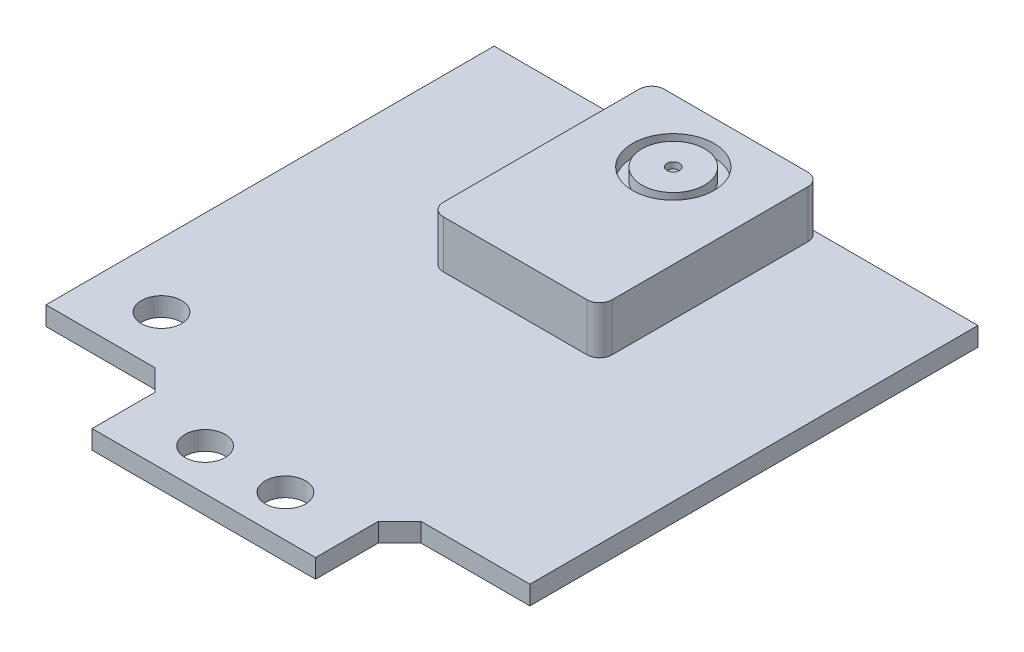
ISO-10303-21;
HEADER;
FILE_DESCRIPTION(('STEP AP214'),'2;1');
FILE_NAME('part.step','',(''),(''),'','','');
FILE_SCHEMA(('AUTOMOTIVE_DESIGN { 1 0 10303 214 1 1 1 1 }'));
ENDSEC;
DATA;
#1=APPLICATION_CONTEXT('core data for automotive mechanical design processes');
#2=APPLICATION_PROTOCOL_DEFINITION('international standard','automotive_design',2000,#1);
#3=PRODUCT_CONTEXT('',#1,'mechanical');
#4=PRODUCT('Part','Part','',(#3));
#5=PRODUCT_RELATED_PRODUCT_CATEGORY('part','',(#4));
#6=PRODUCT_DEFINITION_FORMATION('','',#4);
#7=PRODUCT_DEFINITION_CONTEXT('part definition',#1,'design');
#8=PRODUCT_DEFINITION('design','',#6,#7);
#9=PRODUCT_DEFINITION_SHAPE('','',#8);
#10=(LENGTH_UNIT() NAMED_UNIT(*) SI_UNIT(.MILLI.,.METRE.));
#11=(NAMED_UNIT(*) PLANE_ANGLE_UNIT() SI_UNIT($,.RADIAN.));
#12=(NAMED_UNIT(*) SI_UNIT($,.STERADIAN.) SOLID_ANGLE_UNIT());
#13=UNCERTAINTY_MEASURE_WITH_UNIT(LENGTH_MEASURE(1.E-05),#10,'distance_accuracy_value','');
#14=(GEOMETRIC_REPRESENTATION_CONTEXT(3) GLOBAL_UNCERTAINTY_ASSIGNED_CONTEXT((#13)) GLOBAL_UNIT_ASSIGNED_CONTEXT((#10,
#11,#12)) REPRESENTATION_CONTEXT('',''));
#15=CARTESIAN_POINT('',(0.,0.,0.));
#16=DIRECTION('',(0.,0.,1.));
#17=DIRECTION('',(1.,0.,0.));
#18=AXIS2_PLACEMENT_3D('',#15,#16,#17);
#19=CARTESIAN_POINT('',(6.725,5.3,0.));
#20=DIRECTION('',(-1.,0.,0.));
#21=DIRECTION('',(0.,0.,1.));
#22=AXIS2_PLACEMENT_3D('',#19,#20,#21);
#23=PLANE('',#22);
#24=DIRECTION('',(0.,0.,-1.));
#25=VECTOR('',#24,1.);
#26=CARTESIAN_POINT('',(6.725,1.5,0.));
#27=LINE('',#26,#25);
#28=CARTESIAN_POINT('',(6.725,1.5,-1.25));
#29=VERTEX_POINT('',#28);
#30=CARTESIAN_POINT('',(6.725,1.5,-16.85));
#31=VERTEX_POINT('',#30);
#32=EDGE_CURVE('E253',#29,#31,#27,.T.);
#33=ORIENTED_EDGE('',*,*,#32,.T.);
#34=DIRECTION('',(0.,-1.,0.));
#35=VECTOR('',#34,1.);
#36=CARTESIAN_POINT('',(6.725,5.3,-16.85));
#37=LINE('',#36,#35);
#38=CARTESIAN_POINT('',(6.725,5.3,-16.85));
#39=VERTEX_POINT('',#38);
#40=EDGE_CURVE('E13',#39,#31,#37,.T.);
#41=ORIENTED_EDGE('',*,*,#40,.F.);
#42=DIRECTION('',(0.,0.,-1.));
#43=VECTOR('',#42,1.);
#44=CARTESIAN_POINT('',(6.725,5.3,0.));
#45=LINE('',#44,#43);
#46=CARTESIAN_POINT('',(6.725,5.3,-1.25));
#47=VERTEX_POINT('',#46);
#48=EDGE_CURVE('E211',#47,#39,#45,.T.);
#49=ORIENTED_EDGE('',*,*,#48,.F.);
#50=DIRECTION('',(0.,-1.,0.));
#51=VECTOR('',#50,1.);
#52=CARTESIAN_POINT('',(6.725,5.3,-1.25));
#53=LINE('',#52,#51);
#54=EDGE_CURVE('E174',#47,#29,#53,.T.);
#55=ORIENTED_EDGE('',*,*,#54,.T.);
#56=EDGE_LOOP('',(#33,#41,#49,#55));
#57=FACE_BOUND('',#56,.T.);
#58=ADVANCED_FACE('F158',(#57),#23,.F.);
#59=CARTESIAN_POINT('',(5.725,5.3,-16.85));
#60=DIRECTION('',(0.,-1.,0.));
#61=DIRECTION('',(0.,0.,-1.));
#62=AXIS2_PLACEMENT_3D('',#59,#60,#61);
#63=CYLINDRICAL_SURFACE('',#62,1.);
#64=CARTESIAN_POINT('',(5.725,1.5,-16.85));
#65=DIRECTION('',(0.,-1.,0.));
#66=DIRECTION('',(0.,0.,-1.));
#67=AXIS2_PLACEMENT_3D('',#64,#65,#66);
#68=CIRCLE('',#67,1.);
#69=CARTESIAN_POINT('',(5.725,1.5,-17.85));
#70=VERTEX_POINT('',#69);
#71=EDGE_CURVE('E255',#70,#31,#68,.T.);
#72=ORIENTED_EDGE('',*,*,#71,.F.);
#73=DIRECTION('',(0.,-1.,0.));
#74=VECTOR('',#73,1.);
#75=CARTESIAN_POINT('',(5.725,5.3,-17.85));
#76=LINE('',#75,#74);
#77=CARTESIAN_POINT('',(5.725,5.3,-17.85));
#78=VERTEX_POINT('',#77);
#79=EDGE_CURVE('E166',#78,#70,#76,.T.);
#80=ORIENTED_EDGE('',*,*,#79,.F.);
#81=CARTESIAN_POINT('',(5.725,5.3,-16.85));
#82=DIRECTION('',(0.,-1.,0.));
#83=DIRECTION('',(0.,0.,-1.));
#84=AXIS2_PLACEMENT_3D('',#81,#82,#83);
#85=CIRCLE('',#84,1.);
#86=EDGE_CURVE('E293',#78,#39,#85,.T.);
#87=ORIENTED_EDGE('',*,*,#86,.T.);
#88=ORIENTED_EDGE('',*,*,#40,.T.);
#89=EDGE_LOOP('',(#72,#80,#87,#88));
#90=FACE_BOUND('',#89,.T.);
#91=ADVANCED_FACE('F292',(#90),#63,.T.);
#92=CARTESIAN_POINT('',(0.,5.3,-17.85));
#93=DIRECTION('',(0.,0.,1.));
#94=DIRECTION('',(1.,0.,0.));
#95=AXIS2_PLACEMENT_3D('',#92,#93,#94);
#96=PLANE('',#95);
#97=DIRECTION('',(-1.,0.,0.));
#98=VECTOR('',#97,1.);
#99=CARTESIAN_POINT('',(0.,1.5,-17.85));
#100=LINE('',#99,#98);
#101=CARTESIAN_POINT('',(-5.725,1.5,-17.85));
#102=VERTEX_POINT('',#101);
#103=EDGE_CURVE('E259',#70,#102,#100,.T.);
#104=ORIENTED_EDGE('',*,*,#103,.T.);
#105=DIRECTION('',(0.,-1.,0.));
#106=VECTOR('',#105,1.);
#107=CARTESIAN_POINT('',(-5.725,5.3,-17.85));
#108=LINE('',#107,#106);
#109=CARTESIAN_POINT('',(-5.725,5.3,-17.85));
#110=VERTEX_POINT('',#109);
#111=EDGE_CURVE('E279',#110,#102,#108,.T.);
#112=ORIENTED_EDGE('',*,*,#111,.F.);
#113=DIRECTION('',(-1.,0.,0.));
#114=VECTOR('',#113,1.);
#115=CARTESIAN_POINT('',(0.,5.3,-17.85));
#116=LINE('',#115,#114);
#117=EDGE_CURVE('E285',#78,#110,#116,.T.);
#118=ORIENTED_EDGE('',*,*,#117,.F.);
#119=ORIENTED_EDGE('',*,*,#79,.T.);
#120=EDGE_LOOP('',(#104,#112,#118,#119));
#121=FACE_BOUND('',#120,.T.);
#122=ADVANCED_FACE('F283',(#121),#96,.F.);
#123=CARTESIAN_POINT('',(-5.725,5.3,-16.85));
#124=DIRECTION('',(0.,-1.,0.));
#125=DIRECTION('',(0.,0.,-1.));
#126=AXIS2_PLACEMENT_3D('',#123,#124,#125);
#127=CYLINDRICAL_SURFACE('',#126,1.);
#128=CARTESIAN_POINT('',(-5.725,1.5,-16.85));
#129=DIRECTION('',(0.,-1.,0.));
#130=DIRECTION('',(0.,0.,-1.));
#131=AXIS2_PLACEMENT_3D('',#128,#129,#130);
#132=CIRCLE('',#131,1.);
#133=CARTESIAN_POINT('',(-6.725,1.5,-16.85));
#134=VERTEX_POINT('',#133);
#135=EDGE_CURVE('E262',#134,#102,#132,.T.);
#136=ORIENTED_EDGE('',*,*,#135,.F.);
#137=DIRECTION('',(0.,-1.,0.));
#138=VECTOR('',#137,1.);
#139=CARTESIAN_POINT('',(-6.725,5.3,-16.85));
#140=LINE('',#139,#138);
#141=CARTESIAN_POINT('',(-6.725,5.3,-16.85));
#142=VERTEX_POINT('',#141);
#143=EDGE_CURVE('E277',#142,#134,#140,.T.);
#144=ORIENTED_EDGE('',*,*,#143,.F.);
#145=CARTESIAN_POINT('',(-5.725,5.3,-16.85));
#146=DIRECTION('',(0.,-1.,0.));
#147=DIRECTION('',(0.,0.,-1.));
#148=AXIS2_PLACEMENT_3D('',#145,#146,#147);
#149=CIRCLE('',#148,1.);
#150=EDGE_CURVE('E480',#142,#110,#149,.T.);
#151=ORIENTED_EDGE('',*,*,#150,.T.);
#152=ORIENTED_EDGE('',*,*,#111,.T.);
#153=EDGE_LOOP('',(#136,#144,#151,#152));
#154=FACE_BOUND('',#153,.T.);
#155=ADVANCED_FACE('F313',(#154),#127,.T.);
#156=CARTESIAN_POINT('',(-6.725,5.3,0.));
#157=DIRECTION('',(-1.,0.,0.));
#158=DIRECTION('',(0.,0.,1.));
#159=AXIS2_PLACEMENT_3D('',#156,#157,#158);
#160=PLANE('',#159);
#161=DIRECTION('',(0.,0.,-1.));
#162=VECTOR('',#161,1.);
#163=CARTESIAN_POINT('',(-6.725,1.5,0.));
#164=LINE('',#163,#162);
#165=CARTESIAN_POINT('',(-6.725,1.5,-1.25));
#166=VERTEX_POINT('',#165);
#167=EDGE_CURVE('E265',#166,#134,#164,.T.);
#168=ORIENTED_EDGE('',*,*,#167,.F.);
#169=DIRECTION('',(0.,-1.,0.));
#170=VECTOR('',#169,1.);
#171=CARTESIAN_POINT('',(-6.725,5.3,-1.25));
#172=LINE('',#171,#170);
#173=CARTESIAN_POINT('',(-6.725,5.3,-1.25));
#174=VERTEX_POINT('',#173);
#175=EDGE_CURVE('E237',#174,#166,#172,.T.);
#176=ORIENTED_EDGE('',*,*,#175,.F.);
#177=DIRECTION('',(0.,0.,-1.));
#178=VECTOR('',#177,1.);
#179=CARTESIAN_POINT('',(-6.725,5.3,0.));
#180=LINE('',#179,#178);
#181=EDGE_CURVE('E245',#174,#142,#180,.T.);
#182=ORIENTED_EDGE('',*,*,#181,.T.);
#183=ORIENTED_EDGE('',*,*,#143,.T.);
#184=EDGE_LOOP('',(#168,#176,#182,#183));
#185=FACE_BOUND('',#184,.T.);
#186=ADVANCED_FACE('F318',(#185),#160,.T.);
#187=CARTESIAN_POINT('',(-5.725,5.3,-1.25));
#188=DIRECTION('',(0.,-1.,0.));
#189=DIRECTION('',(0.,0.,-1.));
#190=AXIS2_PLACEMENT_3D('',#187,#188,#189);
#191=CYLINDRICAL_SURFACE('',#190,1.);
#192=CARTESIAN_POINT('',(-5.725,1.5,-1.25));
#193=DIRECTION('',(0.,-1.,0.));
#194=DIRECTION('',(0.,0.,-1.));
#195=AXIS2_PLACEMENT_3D('',#192,#193,#194);
#196=CIRCLE('',#195,1.);
#197=CARTESIAN_POINT('',(-5.725,1.5,-0.249999999999999));
#198=VERTEX_POINT('',#197);
#199=EDGE_CURVE('E233',#198,#166,#196,.T.);
#200=ORIENTED_EDGE('',*,*,#199,.F.);
#201=DIRECTION('',(0.,-1.,0.));
#202=VECTOR('',#201,1.);
#203=CARTESIAN_POINT('',(-5.725,5.3,-0.249999999999999));
#204=LINE('',#203,#202);
#205=CARTESIAN_POINT('',(-5.725,5.3,-0.249999999999999));
#206=VERTEX_POINT('',#205);
#207=EDGE_CURVE('E228',#206,#198,#204,.T.);
#208=ORIENTED_EDGE('',*,*,#207,.F.);
#209=CARTESIAN_POINT('',(-5.725,5.3,-1.25));
#210=DIRECTION('',(0.,-1.,0.));
#211=DIRECTION('',(0.,0.,-1.));
#212=AXIS2_PLACEMENT_3D('',#209,#210,#211);
#213=CIRCLE('',#212,1.);
#214=EDGE_CURVE('E231',#206,#174,#213,.T.);
#215=ORIENTED_EDGE('',*,*,#214,.T.);
#216=ORIENTED_EDGE('',*,*,#175,.T.);
#217=EDGE_LOOP('',(#200,#208,#215,#216));
#218=FACE_BOUND('',#217,.T.);
#219=ADVANCED_FACE('F230',(#218),#191,.T.);
#220=CARTESIAN_POINT('',(0.,5.3,-0.249999999999999));
#221=DIRECTION('',(0.,0.,1.));
#222=DIRECTION('',(1.,0.,0.));
#223=AXIS2_PLACEMENT_3D('',#220,#221,#222);
#224=PLANE('',#223);
#225=DIRECTION('',(-1.,0.,0.));
#226=VECTOR('',#225,1.);
#227=CARTESIAN_POINT('',(0.,1.5,-0.249999999999999));
#228=LINE('',#227,#226);
#229=CARTESIAN_POINT('',(5.725,1.5,-0.25));
#230=VERTEX_POINT('',#229);
#231=EDGE_CURVE('E269',#230,#198,#228,.T.);
#232=ORIENTED_EDGE('',*,*,#231,.F.);
#233=DIRECTION('',(0.,-1.,0.));
#234=VECTOR('',#233,1.);
#235=CARTESIAN_POINT('',(5.725,5.3,-0.25));
#236=LINE('',#235,#234);
#237=CARTESIAN_POINT('',(5.725,5.3,-0.25));
#238=VERTEX_POINT('',#237);
#239=EDGE_CURVE('E199',#238,#230,#236,.T.);
#240=ORIENTED_EDGE('',*,*,#239,.F.);
#241=DIRECTION('',(-1.,0.,0.));
#242=VECTOR('',#241,1.);
#243=CARTESIAN_POINT('',(0.,5.3,-0.249999999999999));
#244=LINE('',#243,#242);
#245=EDGE_CURVE('E242',#238,#206,#244,.T.);
#246=ORIENTED_EDGE('',*,*,#245,.T.);
#247=ORIENTED_EDGE('',*,*,#207,.T.);
#248=EDGE_LOOP('',(#232,#240,#246,#247));
#249=FACE_BOUND('',#248,.T.);
#250=ADVANCED_FACE('F247',(#249),#224,.T.);
#251=CARTESIAN_POINT('',(5.725,5.3,-1.25));
#252=DIRECTION('',(0.,-1.,0.));
#253=DIRECTION('',(0.,0.,-1.));
#254=AXIS2_PLACEMENT_3D('',#251,#252,#253);
#255=CYLINDRICAL_SURFACE('',#254,1.);
#256=CARTESIAN_POINT('',(5.725,1.5,-1.25));
#257=DIRECTION('',(0.,-1.,0.));
#258=DIRECTION('',(0.,0.,-1.));
#259=AXIS2_PLACEMENT_3D('',#256,#257,#258);
#260=CIRCLE('',#259,1.);
#261=EDGE_CURVE('E271',#29,#230,#260,.T.);
#262=ORIENTED_EDGE('',*,*,#261,.F.);
#263=ORIENTED_EDGE('',*,*,#54,.F.);
#264=CARTESIAN_POINT('',(5.725,5.3,-1.25));
#265=DIRECTION('',(0.,-1.,0.));
#266=DIRECTION('',(0.,0.,-1.));
#267=AXIS2_PLACEMENT_3D('',#264,#265,#266);
#268=CIRCLE('',#267,1.);
#269=EDGE_CURVE('E248',#47,#238,#268,.T.);
#270=ORIENTED_EDGE('',*,*,#269,.T.);
#271=ORIENTED_EDGE('',*,*,#239,.T.);
#272=EDGE_LOOP('',(#262,#263,#270,#271));
#273=FACE_BOUND('',#272,.T.);
#274=ADVANCED_FACE('F294',(#273),#255,.T.);
#275=CARTESIAN_POINT('',(5.725,5.3,-16.85));
#276=DIRECTION('',(0.,-1.,0.));
#277=DIRECTION('',(0.,0.,-1.));
#278=AXIS2_PLACEMENT_3D('',#275,#276,#277);
#279=PLANE('',#278);
#280=CARTESIAN_POINT('',(0.,5.3,-12.85));
#281=DIRECTION('',(0.,-1.,0.));
#282=DIRECTION('',(0.,0.,-1.));
#283=AXIS2_PLACEMENT_3D('',#280,#281,#282);
#284=CIRCLE('',#283,3.25);
#285=CARTESIAN_POINT('',(0.,5.3,-16.1));
#286=VERTEX_POINT('',#285);
#287=EDGE_CURVE('E471',#286,#286,#284,.T.);
#288=ORIENTED_EDGE('',*,*,#287,.T.);
#289=EDGE_LOOP('',(#288));
#290=FACE_BOUND('',#289,.T.);
#291=ORIENTED_EDGE('',*,*,#48,.T.);
#292=ORIENTED_EDGE('',*,*,#86,.F.);
#293=ORIENTED_EDGE('',*,*,#117,.T.);
#294=ORIENTED_EDGE('',*,*,#150,.F.);
#295=ORIENTED_EDGE('',*,*,#181,.F.);
#296=ORIENTED_EDGE('',*,*,#214,.F.);
#297=ORIENTED_EDGE('',*,*,#245,.F.);
#298=ORIENTED_EDGE('',*,*,#269,.F.);
#299=EDGE_LOOP('',(#291,#292,#293,#294,#295,#296,#297,#298));
#300=FACE_BOUND('',#299,.T.);
#301=ADVANCED_FACE('F241',(#290,#300),#279,.F.);
#302=CARTESIAN_POINT('',(5.725,1.5,-16.85));
#303=DIRECTION('',(0.,-1.,0.));
#304=DIRECTION('',(0.,0.,-1.));
#305=AXIS2_PLACEMENT_3D('',#302,#303,#304);
#306=PLANE('',#305);
#307=ORIENTED_EDGE('',*,*,#32,.F.);
#308=ORIENTED_EDGE('',*,*,#261,.T.);
#309=ORIENTED_EDGE('',*,*,#231,.T.);
#310=ORIENTED_EDGE('',*,*,#199,.T.);
#311=ORIENTED_EDGE('',*,*,#167,.T.);
#312=ORIENTED_EDGE('',*,*,#135,.T.);
#313=ORIENTED_EDGE('',*,*,#103,.F.);
#314=ORIENTED_EDGE('',*,*,#71,.T.);
#315=EDGE_LOOP('',(#307,#308,#309,#310,#311,#312,#313,#314));
#316=FACE_BOUND('',#315,.T.);
#317=ADVANCED_FACE('F290',(#316),#306,.T.);
#318=CARTESIAN_POINT('',(0.,4.3,-12.85));
#319=DIRECTION('',(0.,-1.,0.));
#320=DIRECTION('',(0.,0.,-1.));
#321=AXIS2_PLACEMENT_3D('',#318,#319,#320);
#322=PLANE('',#321);
#323=CARTESIAN_POINT('',(0.,4.3,-12.85));
#324=DIRECTION('',(0.,-1.,0.));
#325=DIRECTION('',(0.,0.,-1.));
#326=AXIS2_PLACEMENT_3D('',#323,#324,#325);
#327=CIRCLE('',#326,3.25);
#328=CARTESIAN_POINT('',(0.,4.3,-16.1));
#329=VERTEX_POINT('',#328);
#330=EDGE_CURVE('E256',#329,#329,#327,.T.);
#331=ORIENTED_EDGE('',*,*,#330,.F.);
#332=EDGE_LOOP('',(#331));
#333=FACE_BOUND('',#332,.T.);
#334=CARTESIAN_POINT('',(0.,4.3,-12.85));
#335=DIRECTION('',(0.,-1.,0.));
#336=DIRECTION('',(0.,0.,-1.));
#337=AXIS2_PLACEMENT_3D('',#334,#335,#336);
#338=CIRCLE('',#337,2.5);
#339=CARTESIAN_POINT('',(0.,4.3,-15.35));
#340=VERTEX_POINT('',#339);
#341=EDGE_CURVE('E465',#340,#340,#338,.T.);
#342=ORIENTED_EDGE('',*,*,#341,.T.);
#343=EDGE_LOOP('',(#342));
#344=FACE_BOUND('',#343,.T.);
#345=ADVANCED_FACE('F347',(#333,#344),#322,.F.);
#346=CARTESIAN_POINT('',(0.,4.3,-12.85));
#347=DIRECTION('',(0.,1.,0.));
#348=DIRECTION('',(0.,0.,1.));
#349=AXIS2_PLACEMENT_3D('',#346,#347,#348);
#350=CYLINDRICAL_SURFACE('',#349,3.25);
#351=ORIENTED_EDGE('',*,*,#330,.T.);
#352=EDGE_LOOP('',(#351));
#353=FACE_BOUND('',#352,.T.);
#354=ORIENTED_EDGE('',*,*,#287,.F.);
#355=EDGE_LOOP('',(#354));
#356=FACE_BOUND('',#355,.T.);
#357=ADVANCED_FACE('F354',(#353,#356),#350,.F.);
#358=CARTESIAN_POINT('',(0.,4.3,-12.85));
#359=DIRECTION('',(0.,1.,0.));
#360=DIRECTION('',(0.,0.,1.));
#361=AXIS2_PLACEMENT_3D('',#358,#359,#360);
#362=CYLINDRICAL_SURFACE('',#361,2.5);
#363=ORIENTED_EDGE('',*,*,#341,.F.);
#364=EDGE_LOOP('',(#363));
#365=FACE_BOUND('',#364,.T.);
#366=CARTESIAN_POINT('',(0.,5.3,-12.85));
#367=DIRECTION('',(0.,-1.,0.));
#368=DIRECTION('',(0.,0.,-1.));
#369=AXIS2_PLACEMENT_3D('',#366,#367,#368);
#370=CIRCLE('',#369,2.5);
#371=CARTESIAN_POINT('',(0.,5.3,-15.35));
#372=VERTEX_POINT('',#371);
#373=EDGE_CURVE('E461',#372,#372,#370,.T.);
#374=ORIENTED_EDGE('',*,*,#373,.T.);
#375=EDGE_LOOP('',(#374));
#376=FACE_BOUND('',#375,.T.);
#377=ADVANCED_FACE('F363',(#365,#376),#362,.T.);
#378=CARTESIAN_POINT('',(0.,5.3,-12.85));
#379=DIRECTION('',(0.,1.,0.));
#380=DIRECTION('',(0.,0.,1.));
#381=AXIS2_PLACEMENT_3D('',#378,#379,#380);
#382=CIRCLE('',#381,0.5);
#383=CARTESIAN_POINT('',(0.,5.3,-12.35));
#384=VERTEX_POINT('',#383);
#385=EDGE_CURVE('E462',#384,#384,#382,.T.);
#386=ORIENTED_EDGE('',*,*,#385,.F.);
#387=EDGE_LOOP('',(#386));
#388=FACE_BOUND('',#387,.T.);
#389=ORIENTED_EDGE('',*,*,#373,.F.);
#390=EDGE_LOOP('',(#389));
#391=FACE_BOUND('',#390,.T.);
#392=ADVANCED_FACE('F303',(#388,#391),#279,.F.);
#393=CARTESIAN_POINT('',(0.,4.8,-12.85));
#394=DIRECTION('',(0.,1.,0.));
#395=DIRECTION('',(0.,0.,1.));
#396=AXIS2_PLACEMENT_3D('',#393,#394,#395);
#397=CYLINDRICAL_SURFACE('',#396,0.5);
#398=CARTESIAN_POINT('',(0.,4.8,-12.85));
#399=DIRECTION('',(0.,1.,0.));
#400=DIRECTION('',(0.,0.,1.));
#401=AXIS2_PLACEMENT_3D('',#398,#399,#400);
#402=CIRCLE('',#401,0.5);
#403=CARTESIAN_POINT('',(0.,4.8,-12.35));
#404=VERTEX_POINT('',#403);
#405=EDGE_CURVE('E460',#404,#404,#402,.T.);
#406=ORIENTED_EDGE('',*,*,#405,.F.);
#407=EDGE_LOOP('',(#406));
#408=FACE_BOUND('',#407,.T.);
#409=ORIENTED_EDGE('',*,*,#385,.T.);
#410=EDGE_LOOP('',(#409));
#411=FACE_BOUND('',#410,.T.);
#412=ADVANCED_FACE('F381',(#408,#411),#397,.F.);
#413=CARTESIAN_POINT('',(0.,4.8,-12.85));
#414=DIRECTION('',(0.,1.,0.));
#415=DIRECTION('',(0.,0.,1.));
#416=AXIS2_PLACEMENT_3D('',#413,#414,#415);
#417=PLANE('',#416);
#418=ORIENTED_EDGE('',*,*,#405,.T.);
#419=EDGE_LOOP('',(#418));
#420=FACE_BOUND('',#419,.T.);
#421=ADVANCED_FACE('F388',(#420),#417,.T.);
#422=CLOSED_SHELL('',(#58,#91,#122,#155,#186,#219,#250,#274,#301,#317,#345,#357,#377,#392,#412,#421));
#423=MANIFOLD_SOLID_BREP('B2',#422);
#424=CARTESIAN_POINT('',(0.,1.5,0.));
#425=DIRECTION('',(0.,-1.,0.));
#426=DIRECTION('',(0.,0.,-1.));
#427=AXIS2_PLACEMENT_3D('',#424,#425,#426);
#428=PLANE('',#427);
#429=CARTESIAN_POINT('',(3.20000000000001,1.5,21.25));
#430=DIRECTION('',(0.,1.,0.));
#431=DIRECTION('',(0.,0.,1.));
#432=AXIS2_PLACEMENT_3D('',#429,#430,#431);
#433=CIRCLE('',#432,1.6);
#434=CARTESIAN_POINT('',(3.20000000000001,1.5,22.85));
#435=VERTEX_POINT('',#434);
#436=EDGE_CURVE('E730',#435,#435,#433,.F.);
#437=ORIENTED_EDGE('',*,*,#436,.T.);
#438=EDGE_LOOP('',(#437));
#439=FACE_BOUND('',#438,.T.);
#440=DIRECTION('',(1.,0.,0.));
#441=VECTOR('',#440,1.);
#442=CARTESIAN_POINT('',(-19.275,1.5,-17.85));
#443=LINE('',#442,#441);
#444=CARTESIAN_POINT('',(-19.275,1.5,-17.85));
#445=VERTEX_POINT('',#444);
#446=CARTESIAN_POINT('',(19.275,1.5,-17.85));
#447=VERTEX_POINT('',#446);
#448=EDGE_CURVE('E659',#445,#447,#443,.T.);
#449=ORIENTED_EDGE('',*,*,#448,.F.);
#450=DIRECTION('',(0.,0.,1.));
#451=VECTOR('',#450,1.);
#452=CARTESIAN_POINT('',(-19.275,1.5,-17.85));
#453=LINE('',#452,#451);
#454=CARTESIAN_POINT('',(-19.275,1.5,17.85));
#455=VERTEX_POINT('',#454);
#456=EDGE_CURVE('E598',#445,#455,#453,.T.);
#457=ORIENTED_EDGE('',*,*,#456,.T.);
#458=DIRECTION('',(1.,0.,0.));
#459=VECTOR('',#458,1.);
#460=CARTESIAN_POINT('',(-19.275,1.5,17.85));
#461=LINE('',#460,#459);
#462=CARTESIAN_POINT('',(-10.6,1.5,17.85));
#463=VERTEX_POINT('',#462);
#464=EDGE_CURVE('E591',#455,#463,#461,.T.);
#465=ORIENTED_EDGE('',*,*,#464,.T.);
#466=DIRECTION('',(0.707106781186547,0.,0.707106781186548));
#467=VECTOR('',#466,1.);
#468=CARTESIAN_POINT('',(-10.6,1.5,17.85));
#469=LINE('',#468,#467);
#470=CARTESIAN_POINT('',(-8.9,1.5,19.55));
#471=VERTEX_POINT('',#470);
#472=EDGE_CURVE('E596',#463,#471,#469,.T.);
#473=ORIENTED_EDGE('',*,*,#472,.T.);
#474=DIRECTION('',(0.,0.,1.));
#475=VECTOR('',#474,1.);
#476=CARTESIAN_POINT('',(-8.9,1.5,19.55));
#477=LINE('',#476,#475);
#478=CARTESIAN_POINT('',(-8.89999999999999,1.5,24.55));
#479=VERTEX_POINT('',#478);
#480=EDGE_CURVE('E616',#471,#479,#477,.T.);
#481=ORIENTED_EDGE('',*,*,#480,.T.);
#482=DIRECTION('',(1.,0.,0.));
#483=VECTOR('',#482,1.);
#484=CARTESIAN_POINT('',(-8.89999999999999,1.5,24.55));
#485=LINE('',#484,#483);
#486=CARTESIAN_POINT('',(8.90000000000001,1.5,24.55));
#487=VERTEX_POINT('',#486);
#488=EDGE_CURVE('E619',#479,#487,#485,.T.);
#489=ORIENTED_EDGE('',*,*,#488,.T.);
#490=DIRECTION('',(0.,0.,1.));
#491=VECTOR('',#490,1.);
#492=CARTESIAN_POINT('',(8.90000000000001,1.5,19.55));
#493=LINE('',#492,#491);
#494=CARTESIAN_POINT('',(8.90000000000001,1.5,19.55));
#495=VERTEX_POINT('',#494);
#496=EDGE_CURVE('E695',#495,#487,#493,.T.);
#497=ORIENTED_EDGE('',*,*,#496,.F.);
#498=DIRECTION('',(-0.707106781186547,0.,0.707106781186548));
#499=VECTOR('',#498,1.);
#500=CARTESIAN_POINT('',(10.6,1.5,17.85));
#501=LINE('',#500,#499);
#502=CARTESIAN_POINT('',(10.6,1.5,17.85));
#503=VERTEX_POINT('',#502);
#504=EDGE_CURVE('E704',#503,#495,#501,.T.);
#505=ORIENTED_EDGE('',*,*,#504,.F.);
#506=DIRECTION('',(-1.,0.,0.));
#507=VECTOR('',#506,1.);
#508=CARTESIAN_POINT('',(19.275,1.5,17.85));
#509=LINE('',#508,#507);
#510=CARTESIAN_POINT('',(19.275,1.5,17.85));
#511=VERTEX_POINT('',#510);
#512=EDGE_CURVE('E707',#511,#503,#509,.T.);
#513=ORIENTED_EDGE('',*,*,#512,.F.);
#514=DIRECTION('',(0.,0.,1.));
#515=VECTOR('',#514,1.);
#516=CARTESIAN_POINT('',(19.275,1.5,-17.85));
#517=LINE('',#516,#515);
#518=EDGE_CURVE('E713',#447,#511,#517,.T.);
#519=ORIENTED_EDGE('',*,*,#518,.F.);
#520=EDGE_LOOP('',(#449,#457,#465,#473,#481,#489,#497,#505,#513,#519));
#521=FACE_BOUND('',#520,.T.);
#522=CARTESIAN_POINT('',(-14.175,1.5,13.75));
#523=DIRECTION('',(0.,1.,0.));
#524=DIRECTION('',(0.,0.,1.));
#525=AXIS2_PLACEMENT_3D('',#522,#523,#524);
#526=CIRCLE('',#525,1.6);
#527=CARTESIAN_POINT('',(-14.175,1.5,15.35));
#528=VERTEX_POINT('',#527);
#529=EDGE_CURVE('E630',#528,#528,#526,.T.);
#530=ORIENTED_EDGE('',*,*,#529,.F.);
#531=EDGE_LOOP('',(#530));
#532=FACE_BOUND('',#531,.T.);
#533=CARTESIAN_POINT('',(-3.19999999999999,1.5,21.25));
#534=DIRECTION('',(0.,1.,0.));
#535=DIRECTION('',(0.,0.,1.));
#536=AXIS2_PLACEMENT_3D('',#533,#534,#535);
#537=CIRCLE('',#536,1.6);
#538=CARTESIAN_POINT('',(-3.19999999999999,1.5,22.85));
#539=VERTEX_POINT('',#538);
#540=EDGE_CURVE('E722',#539,#539,#537,.T.);
#541=ORIENTED_EDGE('',*,*,#540,.F.);
#542=EDGE_LOOP('',(#541));
#543=FACE_BOUND('',#542,.T.);
#544=ADVANCED_FACE('F508',(#439,#521,#532,#543),#428,.F.);
#545=CARTESIAN_POINT('',(0.,0.,0.));
#546=DIRECTION('',(0.,-1.,0.));
#547=DIRECTION('',(0.,0.,-1.));
#548=AXIS2_PLACEMENT_3D('',#545,#546,#547);
#549=PLANE('',#548);
#550=CARTESIAN_POINT('',(3.20000000000001,0.,21.25));
#551=DIRECTION('',(0.,1.,0.));
#552=DIRECTION('',(0.,0.,1.));
#553=AXIS2_PLACEMENT_3D('',#550,#551,#552);
#554=CIRCLE('',#553,1.6);
#555=CARTESIAN_POINT('',(3.20000000000001,0.,22.85));
#556=VERTEX_POINT('',#555);
#557=EDGE_CURVE('E734',#556,#556,#554,.F.);
#558=ORIENTED_EDGE('',*,*,#557,.F.);
#559=EDGE_LOOP('',(#558));
#560=FACE_BOUND('',#559,.T.);
#561=CARTESIAN_POINT('',(-14.175,0.,13.75));
#562=DIRECTION('',(0.,1.,0.));
#563=DIRECTION('',(0.,0.,1.));
#564=AXIS2_PLACEMENT_3D('',#561,#562,#563);
#565=CIRCLE('',#564,1.6);
#566=CARTESIAN_POINT('',(-14.175,0.,15.35));
#567=VERTEX_POINT('',#566);
#568=EDGE_CURVE('E718',#567,#567,#565,.T.);
#569=ORIENTED_EDGE('',*,*,#568,.T.);
#570=EDGE_LOOP('',(#569));
#571=FACE_BOUND('',#570,.T.);
#572=DIRECTION('',(1.,0.,0.));
#573=VECTOR('',#572,1.);
#574=CARTESIAN_POINT('',(-19.275,0.,-17.85));
#575=LINE('',#574,#573);
#576=CARTESIAN_POINT('',(-19.275,0.,-17.85));
#577=VERTEX_POINT('',#576);
#578=CARTESIAN_POINT('',(19.275,0.,-17.85));
#579=VERTEX_POINT('',#578);
#580=EDGE_CURVE('E625',#577,#579,#575,.T.);
#581=ORIENTED_EDGE('',*,*,#580,.T.);
#582=DIRECTION('',(0.,0.,1.));
#583=VECTOR('',#582,1.);
#584=CARTESIAN_POINT('',(19.275,0.,-17.85));
#585=LINE('',#584,#583);
#586=CARTESIAN_POINT('',(19.275,0.,17.85));
#587=VERTEX_POINT('',#586);
#588=EDGE_CURVE('E629',#579,#587,#585,.T.);
#589=ORIENTED_EDGE('',*,*,#588,.T.);
#590=DIRECTION('',(-1.,0.,0.));
#591=VECTOR('',#590,1.);
#592=CARTESIAN_POINT('',(19.275,0.,17.85));
#593=LINE('',#592,#591);
#594=CARTESIAN_POINT('',(10.6,0.,17.85));
#595=VERTEX_POINT('',#594);
#596=EDGE_CURVE('E634',#587,#595,#593,.T.);
#597=ORIENTED_EDGE('',*,*,#596,.T.);
#598=DIRECTION('',(-0.707106781186547,0.,0.707106781186548));
#599=VECTOR('',#598,1.);
#600=CARTESIAN_POINT('',(10.6,0.,17.85));
#601=LINE('',#600,#599);
#602=CARTESIAN_POINT('',(8.90000000000001,0.,19.55));
#603=VERTEX_POINT('',#602);
#604=EDGE_CURVE('E638',#595,#603,#601,.T.);
#605=ORIENTED_EDGE('',*,*,#604,.T.);
#606=DIRECTION('',(0.,0.,1.));
#607=VECTOR('',#606,1.);
#608=CARTESIAN_POINT('',(8.90000000000001,0.,19.55));
#609=LINE('',#608,#607);
#610=CARTESIAN_POINT('',(8.90000000000001,0.,24.55));
#611=VERTEX_POINT('',#610);
#612=EDGE_CURVE('E642',#603,#611,#609,.T.);
#613=ORIENTED_EDGE('',*,*,#612,.T.);
#614=DIRECTION('',(1.,0.,0.));
#615=VECTOR('',#614,1.);
#616=CARTESIAN_POINT('',(-8.89999999999999,0.,24.55));
#617=LINE('',#616,#615);
#618=CARTESIAN_POINT('',(-8.89999999999999,0.,24.55));
#619=VERTEX_POINT('',#618);
#620=EDGE_CURVE('E646',#619,#611,#617,.T.);
#621=ORIENTED_EDGE('',*,*,#620,.F.);
#622=DIRECTION('',(0.,0.,1.));
#623=VECTOR('',#622,1.);
#624=CARTESIAN_POINT('',(-8.9,0.,19.55));
#625=LINE('',#624,#623);
#626=CARTESIAN_POINT('',(-8.9,0.,19.55));
#627=VERTEX_POINT('',#626);
#628=EDGE_CURVE('E650',#627,#619,#625,.T.);
#629=ORIENTED_EDGE('',*,*,#628,.F.);
#630=DIRECTION('',(0.707106781186547,0.,0.707106781186548));
#631=VECTOR('',#630,1.);
#632=CARTESIAN_POINT('',(-10.6,0.,17.85));
#633=LINE('',#632,#631);
#634=CARTESIAN_POINT('',(-10.6,0.,17.85));
#635=VERTEX_POINT('',#634);
#636=EDGE_CURVE('E653',#635,#627,#633,.T.);
#637=ORIENTED_EDGE('',*,*,#636,.F.);
#638=DIRECTION('',(1.,0.,0.));
#639=VECTOR('',#638,1.);
#640=CARTESIAN_POINT('',(-19.275,0.,17.85));
#641=LINE('',#640,#639);
#642=CARTESIAN_POINT('',(-19.275,0.,17.85));
#643=VERTEX_POINT('',#642);
#644=EDGE_CURVE('E606',#643,#635,#641,.T.);
#645=ORIENTED_EDGE('',*,*,#644,.F.);
#646=DIRECTION('',(0.,0.,1.));
#647=VECTOR('',#646,1.);
#648=CARTESIAN_POINT('',(-19.275,0.,-17.85));
#649=LINE('',#648,#647);
#650=EDGE_CURVE('E561',#577,#643,#649,.T.);
#651=ORIENTED_EDGE('',*,*,#650,.F.);
#652=EDGE_LOOP('',(#581,#589,#597,#605,#613,#621,#629,#637,#645,#651));
#653=FACE_BOUND('',#652,.T.);
#654=CARTESIAN_POINT('',(-3.19999999999999,0.,21.25));
#655=DIRECTION('',(0.,1.,0.));
#656=DIRECTION('',(0.,0.,1.));
#657=AXIS2_PLACEMENT_3D('',#654,#655,#656);
#658=CIRCLE('',#657,1.6);
#659=CARTESIAN_POINT('',(-3.19999999999999,0.,22.85));
#660=VERTEX_POINT('',#659);
#661=EDGE_CURVE('E726',#660,#660,#658,.T.);
#662=ORIENTED_EDGE('',*,*,#661,.T.);
#663=EDGE_LOOP('',(#662));
#664=FACE_BOUND('',#663,.T.);
#665=ADVANCED_FACE('F683',(#560,#571,#653,#664),#549,.T.);
#666=CARTESIAN_POINT('',(-19.275,1.5,-17.85));
#667=DIRECTION('',(0.,0.,-1.));
#668=DIRECTION('',(-1.,0.,0.));
#669=AXIS2_PLACEMENT_3D('',#666,#667,#668);
#670=PLANE('',#669);
#671=ORIENTED_EDGE('',*,*,#580,.F.);
#672=DIRECTION('',(0.,-1.,0.));
#673=VECTOR('',#672,1.);
#674=CARTESIAN_POINT('',(-19.275,1.5,-17.85));
#675=LINE('',#674,#673);
#676=EDGE_CURVE('E156',#445,#577,#675,.T.);
#677=ORIENTED_EDGE('',*,*,#676,.F.);
#678=ORIENTED_EDGE('',*,*,#448,.T.);
#679=DIRECTION('',(0.,-1.,0.));
#680=VECTOR('',#679,1.);
#681=CARTESIAN_POINT('',(19.275,1.5,-17.85));
#682=LINE('',#681,#680);
#683=EDGE_CURVE('E512',#447,#579,#682,.T.);
#684=ORIENTED_EDGE('',*,*,#683,.T.);
#685=EDGE_LOOP('',(#671,#677,#678,#684));
#686=FACE_BOUND('',#685,.T.);
#687=ADVANCED_FACE('F510',(#686),#670,.T.);
#688=CARTESIAN_POINT('',(-19.275,1.5,-17.85));
#689=DIRECTION('',(1.,0.,0.));
#690=DIRECTION('',(0.,0.,-1.));
#691=AXIS2_PLACEMENT_3D('',#688,#689,#690);
#692=PLANE('',#691);
#693=ORIENTED_EDGE('',*,*,#650,.T.);
#694=DIRECTION('',(0.,-1.,0.));
#695=VECTOR('',#694,1.);
#696=CARTESIAN_POINT('',(-19.275,1.5,17.85));
#697=LINE('',#696,#695);
#698=EDGE_CURVE('E519',#455,#643,#697,.T.);
#699=ORIENTED_EDGE('',*,*,#698,.F.);
#700=ORIENTED_EDGE('',*,*,#456,.F.);
#701=ORIENTED_EDGE('',*,*,#676,.T.);
#702=EDGE_LOOP('',(#693,#699,#700,#701));
#703=FACE_BOUND('',#702,.T.);
#704=ADVANCED_FACE('F771',(#703),#692,.F.);
#705=CARTESIAN_POINT('',(-19.275,1.5,17.85));
#706=DIRECTION('',(0.,0.,-1.));
#707=DIRECTION('',(-1.,0.,0.));
#708=AXIS2_PLACEMENT_3D('',#705,#706,#707);
#709=PLANE('',#708);
#710=ORIENTED_EDGE('',*,*,#644,.T.);
#711=DIRECTION('',(0.,-1.,0.));
#712=VECTOR('',#711,1.);
#713=CARTESIAN_POINT('',(-10.6,1.5,17.85));
#714=LINE('',#713,#712);
#715=EDGE_CURVE('E603',#463,#635,#714,.T.);
#716=ORIENTED_EDGE('',*,*,#715,.F.);
#717=ORIENTED_EDGE('',*,*,#464,.F.);
#718=ORIENTED_EDGE('',*,*,#698,.T.);
#719=EDGE_LOOP('',(#710,#716,#717,#718));
#720=FACE_BOUND('',#719,.T.);
#721=ADVANCED_FACE('F604',(#720),#709,.F.);
#722=CARTESIAN_POINT('',(-10.6,1.5,17.85));
#723=DIRECTION('',(0.707106781186548,0.,-0.707106781186547));
#724=DIRECTION('',(-0.707106781186547,0.,-0.707106781186548));
#725=AXIS2_PLACEMENT_3D('',#722,#723,#724);
#726=PLANE('',#725);
#727=ORIENTED_EDGE('',*,*,#636,.T.);
#728=DIRECTION('',(0.,-1.,0.));
#729=VECTOR('',#728,1.);
#730=CARTESIAN_POINT('',(-8.9,1.5,19.55));
#731=LINE('',#730,#729);
#732=EDGE_CURVE('E610',#471,#627,#731,.T.);
#733=ORIENTED_EDGE('',*,*,#732,.F.);
#734=ORIENTED_EDGE('',*,*,#472,.F.);
#735=ORIENTED_EDGE('',*,*,#715,.T.);
#736=EDGE_LOOP('',(#727,#733,#734,#735));
#737=FACE_BOUND('',#736,.T.);
#738=ADVANCED_FACE('F612',(#737),#726,.F.);
#739=CARTESIAN_POINT('',(-8.9,1.5,19.55));
#740=DIRECTION('',(1.,0.,0.));
#741=DIRECTION('',(0.,0.,-1.));
#742=AXIS2_PLACEMENT_3D('',#739,#740,#741);
#743=PLANE('',#742);
#744=ORIENTED_EDGE('',*,*,#628,.T.);
#745=DIRECTION('',(0.,-1.,0.));
#746=VECTOR('',#745,1.);
#747=CARTESIAN_POINT('',(-8.89999999999999,1.5,24.55));
#748=LINE('',#747,#746);
#749=EDGE_CURVE('E665',#479,#619,#748,.T.);
#750=ORIENTED_EDGE('',*,*,#749,.F.);
#751=ORIENTED_EDGE('',*,*,#480,.F.);
#752=ORIENTED_EDGE('',*,*,#732,.T.);
#753=EDGE_LOOP('',(#744,#750,#751,#752));
#754=FACE_BOUND('',#753,.T.);
#755=ADVANCED_FACE('F688',(#754),#743,.F.);
#756=CARTESIAN_POINT('',(-8.89999999999999,1.5,24.55));
#757=DIRECTION('',(0.,0.,-1.));
#758=DIRECTION('',(-1.,0.,0.));
#759=AXIS2_PLACEMENT_3D('',#756,#757,#758);
#760=PLANE('',#759);
#761=ORIENTED_EDGE('',*,*,#620,.T.);
#762=DIRECTION('',(0.,-1.,0.));
#763=VECTOR('',#762,1.);
#764=CARTESIAN_POINT('',(8.90000000000001,1.5,24.55));
#765=LINE('',#764,#763);
#766=EDGE_CURVE('E669',#487,#611,#765,.T.);
#767=ORIENTED_EDGE('',*,*,#766,.F.);
#768=ORIENTED_EDGE('',*,*,#488,.F.);
#769=ORIENTED_EDGE('',*,*,#749,.T.);
#770=EDGE_LOOP('',(#761,#767,#768,#769));
#771=FACE_BOUND('',#770,.T.);
#772=ADVANCED_FACE('F699',(#771),#760,.F.);
#773=CARTESIAN_POINT('',(8.90000000000001,1.5,19.55));
#774=DIRECTION('',(1.,0.,0.));
#775=DIRECTION('',(0.,0.,-1.));
#776=AXIS2_PLACEMENT_3D('',#773,#774,#775);
#777=PLANE('',#776);
#778=ORIENTED_EDGE('',*,*,#612,.F.);
#779=DIRECTION('',(0.,-1.,0.));
#780=VECTOR('',#779,1.);
#781=CARTESIAN_POINT('',(8.90000000000001,1.5,19.55));
#782=LINE('',#781,#780);
#783=EDGE_CURVE('E672',#495,#603,#782,.T.);
#784=ORIENTED_EDGE('',*,*,#783,.F.);
#785=ORIENTED_EDGE('',*,*,#496,.T.);
#786=ORIENTED_EDGE('',*,*,#766,.T.);
#787=EDGE_LOOP('',(#778,#784,#785,#786));
#788=FACE_BOUND('',#787,.T.);
#789=ADVANCED_FACE('F702',(#788),#777,.T.);
#790=CARTESIAN_POINT('',(10.6,1.5,17.85));
#791=DIRECTION('',(0.707106781186548,0.,0.707106781186547));
#792=DIRECTION('',(0.707106781186547,0.,-0.707106781186548));
#793=AXIS2_PLACEMENT_3D('',#790,#791,#792);
#794=PLANE('',#793);
#795=ORIENTED_EDGE('',*,*,#604,.F.);
#796=DIRECTION('',(0.,-1.,0.));
#797=VECTOR('',#796,1.);
#798=CARTESIAN_POINT('',(10.6,1.5,17.85));
#799=LINE('',#798,#797);
#800=EDGE_CURVE('E675',#503,#595,#799,.T.);
#801=ORIENTED_EDGE('',*,*,#800,.F.);
#802=ORIENTED_EDGE('',*,*,#504,.T.);
#803=ORIENTED_EDGE('',*,*,#783,.T.);
#804=EDGE_LOOP('',(#795,#801,#802,#803));
#805=FACE_BOUND('',#804,.T.);
#806=ADVANCED_FACE('F784',(#805),#794,.T.);
#807=CARTESIAN_POINT('',(19.275,1.5,17.85));
#808=DIRECTION('',(0.,0.,1.));
#809=DIRECTION('',(1.,0.,0.));
#810=AXIS2_PLACEMENT_3D('',#807,#808,#809);
#811=PLANE('',#810);
#812=ORIENTED_EDGE('',*,*,#596,.F.);
#813=DIRECTION('',(0.,-1.,0.));
#814=VECTOR('',#813,1.);
#815=CARTESIAN_POINT('',(19.275,1.5,17.85));
#816=LINE('',#815,#814);
#817=EDGE_CURVE('E677',#511,#587,#816,.T.);
#818=ORIENTED_EDGE('',*,*,#817,.F.);
#819=ORIENTED_EDGE('',*,*,#512,.T.);
#820=ORIENTED_EDGE('',*,*,#800,.T.);
#821=EDGE_LOOP('',(#812,#818,#819,#820));
#822=FACE_BOUND('',#821,.T.);
#823=ADVANCED_FACE('F765',(#822),#811,.T.);
#824=CARTESIAN_POINT('',(19.275,1.5,-17.85));
#825=DIRECTION('',(1.,0.,0.));
#826=DIRECTION('',(0.,0.,-1.));
#827=AXIS2_PLACEMENT_3D('',#824,#825,#826);
#828=PLANE('',#827);
#829=ORIENTED_EDGE('',*,*,#588,.F.);
#830=ORIENTED_EDGE('',*,*,#683,.F.);
#831=ORIENTED_EDGE('',*,*,#518,.T.);
#832=ORIENTED_EDGE('',*,*,#817,.T.);
#833=EDGE_LOOP('',(#829,#830,#831,#832));
#834=FACE_BOUND('',#833,.T.);
#835=ADVANCED_FACE('F681',(#834),#828,.T.);
#836=CARTESIAN_POINT('',(-14.175,1.5,13.75));
#837=DIRECTION('',(0.,-1.,0.));
#838=DIRECTION('',(0.,0.,-1.));
#839=AXIS2_PLACEMENT_3D('',#836,#837,#838);
#840=CYLINDRICAL_SURFACE('',#839,1.6);
#841=ORIENTED_EDGE('',*,*,#529,.T.);
#842=EDGE_LOOP('',(#841));
#843=FACE_BOUND('',#842,.T.);
#844=ORIENTED_EDGE('',*,*,#568,.F.);
#845=EDGE_LOOP('',(#844));
#846=FACE_BOUND('',#845,.T.);
#847=ADVANCED_FACE('F755',(#843,#846),#840,.F.);
#848=CARTESIAN_POINT('',(-3.19999999999999,1.5,21.25));
#849=DIRECTION('',(0.,-1.,0.));
#850=DIRECTION('',(0.,0.,-1.));
#851=AXIS2_PLACEMENT_3D('',#848,#849,#850);
#852=CYLINDRICAL_SURFACE('',#851,1.6);
#853=ORIENTED_EDGE('',*,*,#540,.T.);
#854=EDGE_LOOP('',(#853));
#855=FACE_BOUND('',#854,.T.);
#856=ORIENTED_EDGE('',*,*,#661,.F.);
#857=EDGE_LOOP('',(#856));
#858=FACE_BOUND('',#857,.T.);
#859=ADVANCED_FACE('F746',(#855,#858),#852,.F.);
#860=CARTESIAN_POINT('',(3.20000000000001,1.5,21.25));
#861=DIRECTION('',(0.,-1.,0.));
#862=DIRECTION('',(0.,0.,-1.));
#863=AXIS2_PLACEMENT_3D('',#860,#861,#862);
#864=CYLINDRICAL_SURFACE('',#863,1.6);
#865=ORIENTED_EDGE('',*,*,#436,.F.);
#866=EDGE_LOOP('',(#865));
#867=FACE_BOUND('',#866,.T.);
#868=ORIENTED_EDGE('',*,*,#557,.T.);
#869=EDGE_LOOP('',(#868));
#870=FACE_BOUND('',#869,.T.);
#871=ADVANCED_FACE('F743',(#867,#870),#864,.F.);
#872=CLOSED_SHELL('',(#544,#665,#687,#704,#721,#738,#755,#772,#789,#806,#823,#835,#847,#859,#871));
#873=MANIFOLD_SOLID_BREP('B7',#872);
#874=ADVANCED_BREP_SHAPE_REPRESENTATION('',(#18,#423,#873),#14);
#875=SHAPE_DEFINITION_REPRESENTATION(#9,#874);
ENDSEC;
END-ISO-10303-21;
